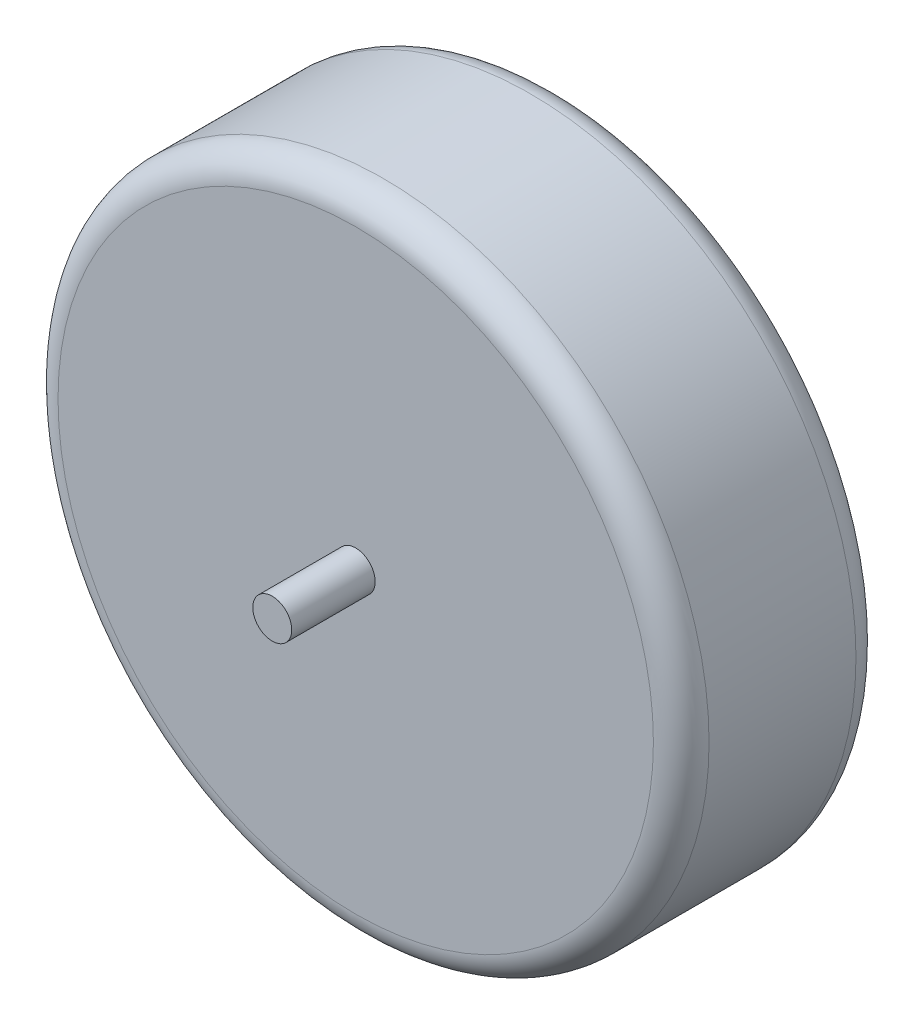
ISO-10303-21;
HEADER;
FILE_DESCRIPTION(('STEP AP214'),'2;1');
FILE_NAME('part.step','',(''),(''),'','','');
FILE_SCHEMA(('AUTOMOTIVE_DESIGN { 1 0 10303 214 1 1 1 1 }'));
ENDSEC;
DATA;
#1=APPLICATION_CONTEXT('core data for automotive mechanical design processes');
#2=APPLICATION_PROTOCOL_DEFINITION('international standard','automotive_design',2000,#1);
#3=PRODUCT_CONTEXT('',#1,'mechanical');
#4=PRODUCT('Part','Part','',(#3));
#5=PRODUCT_RELATED_PRODUCT_CATEGORY('part','',(#4));
#6=PRODUCT_DEFINITION_FORMATION('','',#4);
#7=PRODUCT_DEFINITION_CONTEXT('part definition',#1,'design');
#8=PRODUCT_DEFINITION('design','',#6,#7);
#9=PRODUCT_DEFINITION_SHAPE('','',#8);
#10=(LENGTH_UNIT() NAMED_UNIT(*) SI_UNIT(.MILLI.,.METRE.));
#11=(NAMED_UNIT(*) PLANE_ANGLE_UNIT() SI_UNIT($,.RADIAN.));
#12=(NAMED_UNIT(*) SI_UNIT($,.STERADIAN.) SOLID_ANGLE_UNIT());
#13=UNCERTAINTY_MEASURE_WITH_UNIT(LENGTH_MEASURE(1.E-05),#10,'distance_accuracy_value','');
#14=(GEOMETRIC_REPRESENTATION_CONTEXT(3) GLOBAL_UNCERTAINTY_ASSIGNED_CONTEXT((#13)) GLOBAL_UNIT_ASSIGNED_CONTEXT((#10,
#11,#12)) REPRESENTATION_CONTEXT('',''));
#15=CARTESIAN_POINT('',(0.,0.,0.));
#16=DIRECTION('',(0.,0.,1.));
#17=DIRECTION('',(1.,0.,0.));
#18=AXIS2_PLACEMENT_3D('',#15,#16,#17);
#19=CARTESIAN_POINT('',(0.,0.,46.228));
#20=DIRECTION('',(0.,0.,-1.));
#21=DIRECTION('',(-1.,0.,0.));
#22=AXIS2_PLACEMENT_3D('',#19,#20,#21);
#23=CYLINDRICAL_SURFACE('',#22,74.295);
#24=CARTESIAN_POINT('',(0.,0.,6.35));
#25=DIRECTION('',(0.,0.,1.));
#26=DIRECTION('',(1.,0.,0.));
#27=AXIS2_PLACEMENT_3D('',#24,#25,#26);
#28=CIRCLE('',#27,74.295);
#29=CARTESIAN_POINT('',(74.295,0.,6.35));
#30=VERTEX_POINT('',#29);
#31=EDGE_CURVE('E51',#30,#30,#28,.T.);
#32=ORIENTED_EDGE('',*,*,#31,.T.);
#33=EDGE_LOOP('',(#32));
#34=FACE_BOUND('',#33,.T.);
#35=CARTESIAN_POINT('',(0.,0.,39.878));
#36=DIRECTION('',(0.,0.,1.));
#37=DIRECTION('',(1.,0.,0.));
#38=AXIS2_PLACEMENT_3D('',#35,#36,#37);
#39=CIRCLE('',#38,74.295);
#40=CARTESIAN_POINT('',(74.295,0.,39.878));
#41=VERTEX_POINT('',#40);
#42=EDGE_CURVE('E48',#41,#41,#39,.F.);
#43=ORIENTED_EDGE('',*,*,#42,.T.);
#44=EDGE_LOOP('',(#43));
#45=FACE_BOUND('',#44,.T.);
#46=ADVANCED_FACE('F30',(#34,#45),#23,.T.);
#47=CARTESIAN_POINT('',(0.,0.,46.228));
#48=DIRECTION('',(0.,0.,1.));
#49=DIRECTION('',(1.,0.,0.));
#50=AXIS2_PLACEMENT_3D('',#47,#48,#49);
#51=PLANE('',#50);
#52=CARTESIAN_POINT('',(0.,0.,46.228));
#53=DIRECTION('',(0.,0.,1.));
#54=DIRECTION('',(1.,0.,0.));
#55=AXIS2_PLACEMENT_3D('',#52,#53,#54);
#56=CIRCLE('',#55,4.445);
#57=CARTESIAN_POINT('',(4.445,0.,46.228));
#58=VERTEX_POINT('',#57);
#59=EDGE_CURVE('E10',#58,#58,#56,.T.);
#60=ORIENTED_EDGE('',*,*,#59,.F.);
#61=EDGE_LOOP('',(#60));
#62=FACE_BOUND('',#61,.T.);
#63=CARTESIAN_POINT('',(0.,0.,46.228));
#64=DIRECTION('',(0.,0.,1.));
#65=DIRECTION('',(1.,0.,0.));
#66=AXIS2_PLACEMENT_3D('',#63,#64,#65);
#67=CIRCLE('',#66,67.945);
#68=CARTESIAN_POINT('',(67.945,0.,46.228));
#69=VERTEX_POINT('',#68);
#70=EDGE_CURVE('E38',#69,#69,#67,.T.);
#71=ORIENTED_EDGE('',*,*,#70,.T.);
#72=EDGE_LOOP('',(#71));
#73=FACE_BOUND('',#72,.T.);
#74=ADVANCED_FACE('F66',(#62,#73),#51,.T.);
#75=CARTESIAN_POINT('',(0.,0.,0.));
#76=DIRECTION('',(0.,0.,1.));
#77=DIRECTION('',(1.,0.,0.));
#78=AXIS2_PLACEMENT_3D('',#75,#76,#77);
#79=PLANE('',#78);
#80=CARTESIAN_POINT('',(0.,0.,0.));
#81=DIRECTION('',(0.,0.,1.));
#82=DIRECTION('',(1.,0.,0.));
#83=AXIS2_PLACEMENT_3D('',#80,#81,#82);
#84=CIRCLE('',#83,4.445);
#85=CARTESIAN_POINT('',(4.445,0.,0.));
#86=VERTEX_POINT('',#85);
#87=EDGE_CURVE('E34',#86,#86,#84,.T.);
#88=ORIENTED_EDGE('',*,*,#87,.T.);
#89=EDGE_LOOP('',(#88));
#90=FACE_BOUND('',#89,.T.);
#91=CARTESIAN_POINT('',(0.,0.,0.));
#92=DIRECTION('',(0.,0.,1.));
#93=DIRECTION('',(1.,0.,0.));
#94=AXIS2_PLACEMENT_3D('',#91,#92,#93);
#95=CIRCLE('',#94,67.945);
#96=CARTESIAN_POINT('',(67.945,0.,0.));
#97=VERTEX_POINT('',#96);
#98=EDGE_CURVE('E43',#97,#97,#95,.F.);
#99=ORIENTED_EDGE('',*,*,#98,.T.);
#100=EDGE_LOOP('',(#99));
#101=FACE_BOUND('',#100,.T.);
#102=ADVANCED_FACE('F57',(#90,#101),#79,.F.);
#103=CARTESIAN_POINT('',(0.,0.,6.35));
#104=DIRECTION('',(0.,0.,1.));
#105=DIRECTION('',(1.,0.,0.));
#106=AXIS2_PLACEMENT_3D('',#103,#104,#105);
#107=TOROIDAL_SURFACE('',#106,67.945,6.35);
#108=ORIENTED_EDGE('',*,*,#98,.F.);
#109=EDGE_LOOP('',(#108));
#110=FACE_BOUND('',#109,.T.);
#111=ORIENTED_EDGE('',*,*,#31,.F.);
#112=EDGE_LOOP('',(#111));
#113=FACE_BOUND('',#112,.T.);
#114=ADVANCED_FACE('F59',(#110,#113),#107,.T.);
#115=CARTESIAN_POINT('',(0.,0.,39.878));
#116=DIRECTION('',(0.,0.,1.));
#117=DIRECTION('',(1.,0.,0.));
#118=AXIS2_PLACEMENT_3D('',#115,#116,#117);
#119=TOROIDAL_SURFACE('',#118,67.945,6.35);
#120=ORIENTED_EDGE('',*,*,#42,.F.);
#121=EDGE_LOOP('',(#120));
#122=FACE_BOUND('',#121,.T.);
#123=ORIENTED_EDGE('',*,*,#70,.F.);
#124=EDGE_LOOP('',(#123));
#125=FACE_BOUND('',#124,.T.);
#126=ADVANCED_FACE('F32',(#122,#125),#119,.T.);
#127=CARTESIAN_POINT('',(0.,0.,-19.05));
#128=DIRECTION('',(0.,0.,1.));
#129=DIRECTION('',(1.,0.,0.));
#130=AXIS2_PLACEMENT_3D('',#127,#128,#129);
#131=PLANE('',#130);
#132=CARTESIAN_POINT('',(0.,0.,-19.05));
#133=DIRECTION('',(0.,0.,1.));
#134=DIRECTION('',(1.,0.,0.));
#135=AXIS2_PLACEMENT_3D('',#132,#133,#134);
#136=CIRCLE('',#135,4.445);
#137=CARTESIAN_POINT('',(4.445,0.,-19.05));
#138=VERTEX_POINT('',#137);
#139=EDGE_CURVE('E46',#138,#138,#136,.T.);
#140=ORIENTED_EDGE('',*,*,#139,.F.);
#141=EDGE_LOOP('',(#140));
#142=FACE_BOUND('',#141,.T.);
#143=ADVANCED_FACE('F72',(#142),#131,.F.);
#144=CARTESIAN_POINT('',(0.,0.,-19.05));
#145=DIRECTION('',(0.,0.,1.));
#146=DIRECTION('',(1.,0.,0.));
#147=AXIS2_PLACEMENT_3D('',#144,#145,#146);
#148=CYLINDRICAL_SURFACE('',#147,4.445);
#149=ORIENTED_EDGE('',*,*,#139,.T.);
#150=EDGE_LOOP('',(#149));
#151=FACE_BOUND('',#150,.T.);
#152=ORIENTED_EDGE('',*,*,#87,.F.);
#153=EDGE_LOOP('',(#152));
#154=FACE_BOUND('',#153,.T.);
#155=ADVANCED_FACE('F88',(#151,#154),#148,.T.);
#156=ORIENTED_EDGE('',*,*,#59,.T.);
#157=EDGE_LOOP('',(#156));
#158=FACE_BOUND('',#157,.T.);
#159=CARTESIAN_POINT('',(0.,0.,65.278));
#160=DIRECTION('',(0.,0.,1.));
#161=DIRECTION('',(1.,0.,0.));
#162=AXIS2_PLACEMENT_3D('',#159,#160,#161);
#163=CIRCLE('',#162,4.445);
#164=CARTESIAN_POINT('',(4.445,0.,65.278));
#165=VERTEX_POINT('',#164);
#166=EDGE_CURVE('E98',#165,#165,#163,.T.);
#167=ORIENTED_EDGE('',*,*,#166,.F.);
#168=EDGE_LOOP('',(#167));
#169=FACE_BOUND('',#168,.T.);
#170=ADVANCED_FACE('F84',(#158,#169),#148,.T.);
#171=CARTESIAN_POINT('',(0.,0.,65.278));
#172=DIRECTION('',(0.,0.,1.));
#173=DIRECTION('',(1.,0.,0.));
#174=AXIS2_PLACEMENT_3D('',#171,#172,#173);
#175=PLANE('',#174);
#176=ORIENTED_EDGE('',*,*,#166,.T.);
#177=EDGE_LOOP('',(#176));
#178=FACE_BOUND('',#177,.T.);
#179=ADVANCED_FACE('F87',(#178),#175,.T.);
#180=CLOSED_SHELL('',(#46,#74,#102,#114,#126,#143,#155,#170,#179));
#181=MANIFOLD_SOLID_BREP('B2',#180);
#182=ADVANCED_BREP_SHAPE_REPRESENTATION('',(#18,#181),#14);
#183=SHAPE_DEFINITION_REPRESENTATION(#9,#182);
ENDSEC;
END-ISO-10303-21;
